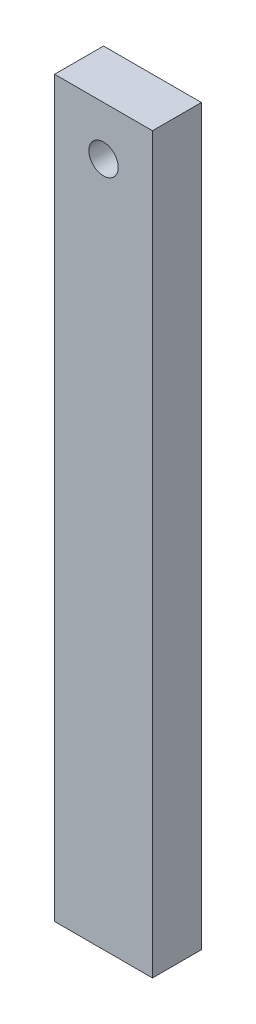
ISO-10303-21;
HEADER;
FILE_DESCRIPTION(('STEP AP214'),'2;1');
FILE_NAME('part.step','',(''),(''),'','','');
FILE_SCHEMA(('AUTOMOTIVE_DESIGN { 1 0 10303 214 1 1 1 1 }'));
ENDSEC;
DATA;
#1=APPLICATION_CONTEXT('core data for automotive mechanical design processes');
#2=APPLICATION_PROTOCOL_DEFINITION('international standard','automotive_design',2000,#1);
#3=PRODUCT_CONTEXT('',#1,'mechanical');
#4=PRODUCT('Part','Part','',(#3));
#5=PRODUCT_RELATED_PRODUCT_CATEGORY('part','',(#4));
#6=PRODUCT_DEFINITION_FORMATION('','',#4);
#7=PRODUCT_DEFINITION_CONTEXT('part definition',#1,'design');
#8=PRODUCT_DEFINITION('design','',#6,#7);
#9=PRODUCT_DEFINITION_SHAPE('','',#8);
#10=(LENGTH_UNIT() NAMED_UNIT(*) SI_UNIT(.MILLI.,.METRE.));
#11=(NAMED_UNIT(*) PLANE_ANGLE_UNIT() SI_UNIT($,.RADIAN.));
#12=(NAMED_UNIT(*) SI_UNIT($,.STERADIAN.) SOLID_ANGLE_UNIT());
#13=UNCERTAINTY_MEASURE_WITH_UNIT(LENGTH_MEASURE(1.E-05),#10,'distance_accuracy_value','');
#14=(GEOMETRIC_REPRESENTATION_CONTEXT(3) GLOBAL_UNCERTAINTY_ASSIGNED_CONTEXT((#13)) GLOBAL_UNIT_ASSIGNED_CONTEXT((#10,
#11,#12)) REPRESENTATION_CONTEXT('',''));
#15=CARTESIAN_POINT('',(0.,0.,0.));
#16=DIRECTION('',(0.,0.,1.));
#17=DIRECTION('',(1.,0.,0.));
#18=AXIS2_PLACEMENT_3D('',#15,#16,#17);
#19=CARTESIAN_POINT('',(10.,-75.,10.));
#20=DIRECTION('',(-1.,0.,0.));
#21=DIRECTION('',(0.,0.,1.));
#22=AXIS2_PLACEMENT_3D('',#19,#20,#21);
#23=PLANE('',#22);
#24=DIRECTION('',(0.,1.,0.));
#25=VECTOR('',#24,1.);
#26=CARTESIAN_POINT('',(10.,-75.,0.));
#27=LINE('',#26,#25);
#28=CARTESIAN_POINT('',(10.,-75.,0.));
#29=VERTEX_POINT('',#28);
#30=CARTESIAN_POINT('',(10.,75.,0.));
#31=VERTEX_POINT('',#30);
#32=EDGE_CURVE('E96',#29,#31,#27,.T.);
#33=ORIENTED_EDGE('',*,*,#32,.T.);
#34=DIRECTION('',(0.,0.,-1.));
#35=VECTOR('',#34,1.);
#36=CARTESIAN_POINT('',(10.,75.,10.));
#37=LINE('',#36,#35);
#38=CARTESIAN_POINT('',(10.,75.,10.));
#39=VERTEX_POINT('',#38);
#40=EDGE_CURVE('E11',#39,#31,#37,.T.);
#41=ORIENTED_EDGE('',*,*,#40,.F.);
#42=DIRECTION('',(0.,1.,0.));
#43=VECTOR('',#42,1.);
#44=CARTESIAN_POINT('',(10.,-75.,10.));
#45=LINE('',#44,#43);
#46=CARTESIAN_POINT('',(10.,-75.,10.));
#47=VERTEX_POINT('',#46);
#48=EDGE_CURVE('E84',#47,#39,#45,.T.);
#49=ORIENTED_EDGE('',*,*,#48,.F.);
#50=DIRECTION('',(0.,0.,-1.));
#51=VECTOR('',#50,1.);
#52=CARTESIAN_POINT('',(10.,-75.,10.));
#53=LINE('',#52,#51);
#54=EDGE_CURVE('E92',#47,#29,#53,.T.);
#55=ORIENTED_EDGE('',*,*,#54,.T.);
#56=EDGE_LOOP('',(#33,#41,#49,#55));
#57=FACE_BOUND('',#56,.T.);
#58=ADVANCED_FACE('F33',(#57),#23,.F.);
#59=CARTESIAN_POINT('',(-10.,75.,10.));
#60=DIRECTION('',(0.,-1.,0.));
#61=DIRECTION('',(0.,0.,-1.));
#62=AXIS2_PLACEMENT_3D('',#59,#60,#61);
#63=PLANE('',#62);
#64=DIRECTION('',(-1.,0.,0.));
#65=VECTOR('',#64,1.);
#66=CARTESIAN_POINT('',(-10.,75.,0.));
#67=LINE('',#66,#65);
#68=CARTESIAN_POINT('',(-10.,75.,0.));
#69=VERTEX_POINT('',#68);
#70=EDGE_CURVE('E88',#31,#69,#67,.T.);
#71=ORIENTED_EDGE('',*,*,#70,.T.);
#72=DIRECTION('',(0.,0.,-1.));
#73=VECTOR('',#72,1.);
#74=CARTESIAN_POINT('',(-10.,75.,10.));
#75=LINE('',#74,#73);
#76=CARTESIAN_POINT('',(-10.,75.,10.));
#77=VERTEX_POINT('',#76);
#78=EDGE_CURVE('E41',#77,#69,#75,.T.);
#79=ORIENTED_EDGE('',*,*,#78,.F.);
#80=DIRECTION('',(-1.,0.,0.));
#81=VECTOR('',#80,1.);
#82=CARTESIAN_POINT('',(-10.,75.,10.));
#83=LINE('',#82,#81);
#84=EDGE_CURVE('E79',#39,#77,#83,.T.);
#85=ORIENTED_EDGE('',*,*,#84,.F.);
#86=ORIENTED_EDGE('',*,*,#40,.T.);
#87=EDGE_LOOP('',(#71,#79,#85,#86));
#88=FACE_BOUND('',#87,.T.);
#89=ADVANCED_FACE('F87',(#88),#63,.F.);
#90=CARTESIAN_POINT('',(-10.,-75.,10.));
#91=DIRECTION('',(1.,0.,0.));
#92=DIRECTION('',(0.,0.,-1.));
#93=AXIS2_PLACEMENT_3D('',#90,#91,#92);
#94=PLANE('',#93);
#95=DIRECTION('',(0.,-1.,0.));
#96=VECTOR('',#95,1.);
#97=CARTESIAN_POINT('',(-10.,-75.,0.));
#98=LINE('',#97,#96);
#99=CARTESIAN_POINT('',(-10.,-75.,0.));
#100=VERTEX_POINT('',#99);
#101=EDGE_CURVE('E66',#69,#100,#98,.T.);
#102=ORIENTED_EDGE('',*,*,#101,.T.);
#103=DIRECTION('',(0.,0.,-1.));
#104=VECTOR('',#103,1.);
#105=CARTESIAN_POINT('',(-10.,-75.,10.));
#106=LINE('',#105,#104);
#107=CARTESIAN_POINT('',(-10.,-75.,10.));
#108=VERTEX_POINT('',#107);
#109=EDGE_CURVE('E89',#108,#100,#106,.T.);
#110=ORIENTED_EDGE('',*,*,#109,.F.);
#111=DIRECTION('',(0.,-1.,0.));
#112=VECTOR('',#111,1.);
#113=CARTESIAN_POINT('',(-10.,-75.,10.));
#114=LINE('',#113,#112);
#115=EDGE_CURVE('E82',#77,#108,#114,.T.);
#116=ORIENTED_EDGE('',*,*,#115,.F.);
#117=ORIENTED_EDGE('',*,*,#78,.T.);
#118=EDGE_LOOP('',(#102,#110,#116,#117));
#119=FACE_BOUND('',#118,.T.);
#120=ADVANCED_FACE('F90',(#119),#94,.F.);
#121=CARTESIAN_POINT('',(-10.,-75.,10.));
#122=DIRECTION('',(0.,1.,0.));
#123=DIRECTION('',(0.,0.,1.));
#124=AXIS2_PLACEMENT_3D('',#121,#122,#123);
#125=PLANE('',#124);
#126=DIRECTION('',(1.,0.,0.));
#127=VECTOR('',#126,1.);
#128=CARTESIAN_POINT('',(-10.,-75.,0.));
#129=LINE('',#128,#127);
#130=EDGE_CURVE('E72',#100,#29,#129,.T.);
#131=ORIENTED_EDGE('',*,*,#130,.T.);
#132=ORIENTED_EDGE('',*,*,#54,.F.);
#133=DIRECTION('',(1.,0.,0.));
#134=VECTOR('',#133,1.);
#135=CARTESIAN_POINT('',(-10.,-75.,10.));
#136=LINE('',#135,#134);
#137=EDGE_CURVE('E49',#108,#47,#136,.T.);
#138=ORIENTED_EDGE('',*,*,#137,.F.);
#139=ORIENTED_EDGE('',*,*,#109,.T.);
#140=EDGE_LOOP('',(#131,#132,#138,#139));
#141=FACE_BOUND('',#140,.T.);
#142=ADVANCED_FACE('F104',(#141),#125,.F.);
#143=CARTESIAN_POINT('',(0.,0.,10.));
#144=DIRECTION('',(0.,0.,-1.));
#145=DIRECTION('',(-1.,0.,0.));
#146=AXIS2_PLACEMENT_3D('',#143,#144,#145);
#147=PLANE('',#146);
#148=CARTESIAN_POINT('',(0.,65.,10.));
#149=DIRECTION('',(0.,0.,1.));
#150=DIRECTION('',(1.,0.,0.));
#151=AXIS2_PLACEMENT_3D('',#148,#149,#150);
#152=CIRCLE('',#151,3.);
#153=CARTESIAN_POINT('',(3.,65.,10.));
#154=VERTEX_POINT('',#153);
#155=EDGE_CURVE('E112',#154,#154,#152,.T.);
#156=ORIENTED_EDGE('',*,*,#155,.F.);
#157=EDGE_LOOP('',(#156));
#158=FACE_BOUND('',#157,.T.);
#159=ORIENTED_EDGE('',*,*,#48,.T.);
#160=ORIENTED_EDGE('',*,*,#84,.T.);
#161=ORIENTED_EDGE('',*,*,#115,.T.);
#162=ORIENTED_EDGE('',*,*,#137,.T.);
#163=EDGE_LOOP('',(#159,#160,#161,#162));
#164=FACE_BOUND('',#163,.T.);
#165=ADVANCED_FACE('F80',(#158,#164),#147,.F.);
#166=CARTESIAN_POINT('',(0.,0.,0.));
#167=DIRECTION('',(0.,0.,-1.));
#168=DIRECTION('',(-1.,0.,0.));
#169=AXIS2_PLACEMENT_3D('',#166,#167,#168);
#170=PLANE('',#169);
#171=CARTESIAN_POINT('',(0.,65.,0.));
#172=DIRECTION('',(0.,0.,-1.));
#173=DIRECTION('',(-1.,0.,0.));
#174=AXIS2_PLACEMENT_3D('',#171,#172,#173);
#175=CIRCLE('',#174,3.);
#176=CARTESIAN_POINT('',(-3.,65.,0.));
#177=VERTEX_POINT('',#176);
#178=EDGE_CURVE('E99',#177,#177,#175,.F.);
#179=ORIENTED_EDGE('',*,*,#178,.T.);
#180=EDGE_LOOP('',(#179));
#181=FACE_BOUND('',#180,.T.);
#182=ORIENTED_EDGE('',*,*,#32,.F.);
#183=ORIENTED_EDGE('',*,*,#130,.F.);
#184=ORIENTED_EDGE('',*,*,#101,.F.);
#185=ORIENTED_EDGE('',*,*,#70,.F.);
#186=EDGE_LOOP('',(#182,#183,#184,#185));
#187=FACE_BOUND('',#186,.T.);
#188=ADVANCED_FACE('F107',(#181,#187),#170,.T.);
#189=CARTESIAN_POINT('',(0.,65.,-8.48528137423858));
#190=DIRECTION('',(0.,0.,1.));
#191=DIRECTION('',(1.,0.,0.));
#192=AXIS2_PLACEMENT_3D('',#189,#190,#191);
#193=CYLINDRICAL_SURFACE('',#192,3.);
#194=ORIENTED_EDGE('',*,*,#155,.T.);
#195=EDGE_LOOP('',(#194));
#196=FACE_BOUND('',#195,.T.);
#197=ORIENTED_EDGE('',*,*,#178,.F.);
#198=EDGE_LOOP('',(#197));
#199=FACE_BOUND('',#198,.T.);
#200=ADVANCED_FACE('F116',(#196,#199),#193,.F.);
#201=CLOSED_SHELL('',(#58,#89,#120,#142,#165,#188,#200));
#202=MANIFOLD_SOLID_BREP('B2',#201);
#203=ADVANCED_BREP_SHAPE_REPRESENTATION('',(#18,#202),#14);
#204=SHAPE_DEFINITION_REPRESENTATION(#9,#203);
ENDSEC;
END-ISO-10303-21;
